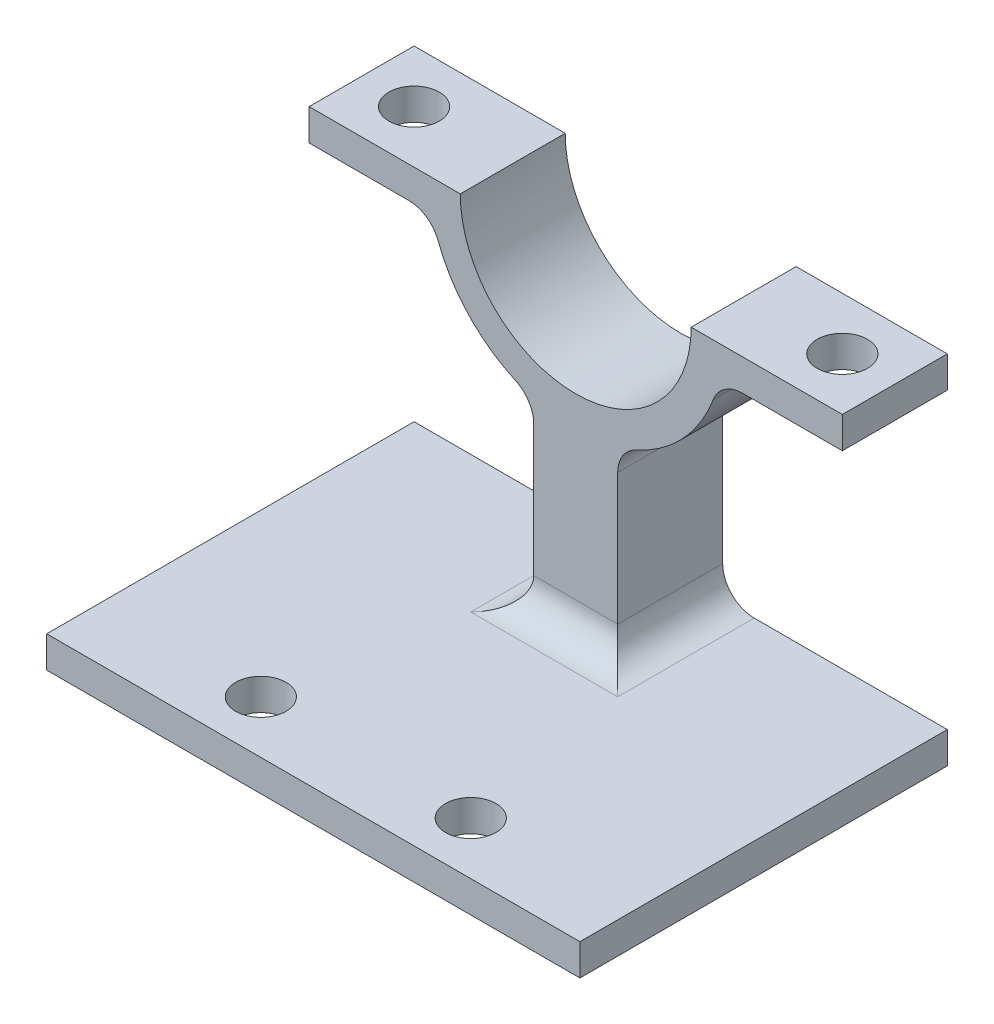
ISO-10303-21;
HEADER;
FILE_DESCRIPTION(('STEP AP214'),'2;1');
FILE_NAME('part.step','',(''),(''),'','','');
FILE_SCHEMA(('AUTOMOTIVE_DESIGN { 1 0 10303 214 1 1 1 1 }'));
ENDSEC;
DATA;
#1=APPLICATION_CONTEXT('core data for automotive mechanical design processes');
#2=APPLICATION_PROTOCOL_DEFINITION('international standard','automotive_design',2000,#1);
#3=PRODUCT_CONTEXT('',#1,'mechanical');
#4=PRODUCT('Part','Part','',(#3));
#5=PRODUCT_RELATED_PRODUCT_CATEGORY('part','',(#4));
#6=PRODUCT_DEFINITION_FORMATION('','',#4);
#7=PRODUCT_DEFINITION_CONTEXT('part definition',#1,'design');
#8=PRODUCT_DEFINITION('design','',#6,#7);
#9=PRODUCT_DEFINITION_SHAPE('','',#8);
#10=(LENGTH_UNIT() NAMED_UNIT(*) SI_UNIT(.MILLI.,.METRE.));
#11=(NAMED_UNIT(*) PLANE_ANGLE_UNIT() SI_UNIT($,.RADIAN.));
#12=(NAMED_UNIT(*) SI_UNIT($,.STERADIAN.) SOLID_ANGLE_UNIT());
#13=UNCERTAINTY_MEASURE_WITH_UNIT(LENGTH_MEASURE(1.E-05),#10,'distance_accuracy_value','');
#14=(GEOMETRIC_REPRESENTATION_CONTEXT(3) GLOBAL_UNCERTAINTY_ASSIGNED_CONTEXT((#13)) GLOBAL_UNIT_ASSIGNED_CONTEXT((#10,
#11,#12)) REPRESENTATION_CONTEXT('',''));
#15=CARTESIAN_POINT('',(0.,0.,0.));
#16=DIRECTION('',(0.,0.,1.));
#17=DIRECTION('',(1.,0.,0.));
#18=AXIS2_PLACEMENT_3D('',#15,#16,#17);
#19=CARTESIAN_POINT('',(0.,0.,2.5));
#20=DIRECTION('',(0.,0.,-1.));
#21=DIRECTION('',(-1.,0.,0.));
#22=AXIS2_PLACEMENT_3D('',#19,#20,#21);
#23=CYLINDRICAL_SURFACE('',#22,7.);
#24=CARTESIAN_POINT('',(0.,0.,2.5));
#25=DIRECTION('',(0.,0.,1.));
#26=DIRECTION('',(1.,0.,0.));
#27=AXIS2_PLACEMENT_3D('',#24,#25,#26);
#28=CIRCLE('',#27,7.);
#29=CARTESIAN_POINT('',(2.88235294117647,-6.37903139375339,2.5));
#30=VERTEX_POINT('',#29);
#31=CARTESIAN_POINT('',(6.54951859082988,-2.47058823529412,2.5));
#32=VERTEX_POINT('',#31);
#33=EDGE_CURVE('E245',#30,#32,#28,.T.);
#34=ORIENTED_EDGE('',*,*,#33,.F.);
#35=DIRECTION('',(0.,0.,-1.));
#36=VECTOR('',#35,1.);
#37=CARTESIAN_POINT('',(2.88235294117647,-6.37903139375339,2.5));
#38=LINE('',#37,#36);
#39=CARTESIAN_POINT('',(2.88235294117647,-6.37903139375339,-2.5));
#40=VERTEX_POINT('',#39);
#41=EDGE_CURVE('E309',#30,#40,#38,.T.);
#42=ORIENTED_EDGE('',*,*,#41,.T.);
#43=CARTESIAN_POINT('',(0.,0.,-2.5));
#44=DIRECTION('',(0.,0.,1.));
#45=DIRECTION('',(1.,0.,0.));
#46=AXIS2_PLACEMENT_3D('',#43,#44,#45);
#47=CIRCLE('',#46,7.);
#48=CARTESIAN_POINT('',(6.54951859082988,-2.47058823529412,-2.5));
#49=VERTEX_POINT('',#48);
#50=EDGE_CURVE('E266',#40,#49,#47,.T.);
#51=ORIENTED_EDGE('',*,*,#50,.T.);
#52=DIRECTION('',(0.,0.,-1.));
#53=VECTOR('',#52,1.);
#54=CARTESIAN_POINT('',(6.54951859082989,-2.47058823529412,2.5));
#55=LINE('',#54,#53);
#56=EDGE_CURVE('E307',#49,#32,#55,.F.);
#57=ORIENTED_EDGE('',*,*,#56,.T.);
#58=EDGE_LOOP('',(#34,#42,#51,#57));
#59=FACE_BOUND('',#58,.T.);
#60=ADVANCED_FACE('F32',(#59),#23,.T.);
#61=CARTESIAN_POINT('',(-6.54951859082988,-2.47058823529412,2.5));
#62=VERTEX_POINT('',#61);
#63=CARTESIAN_POINT('',(-2.88235294117647,-6.37903139375339,2.5));
#64=VERTEX_POINT('',#63);
#65=EDGE_CURVE('E248',#62,#64,#28,.T.);
#66=ORIENTED_EDGE('',*,*,#65,.F.);
#67=DIRECTION('',(0.,0.,-1.));
#68=VECTOR('',#67,1.);
#69=CARTESIAN_POINT('',(-6.54951859082988,-2.47058823529412,2.5));
#70=LINE('',#69,#68);
#71=CARTESIAN_POINT('',(-6.54951859082988,-2.47058823529412,-2.5));
#72=VERTEX_POINT('',#71);
#73=EDGE_CURVE('E318',#62,#72,#70,.T.);
#74=ORIENTED_EDGE('',*,*,#73,.T.);
#75=CARTESIAN_POINT('',(-2.88235294117647,-6.37903139375339,-2.5));
#76=VERTEX_POINT('',#75);
#77=EDGE_CURVE('E267',#72,#76,#47,.T.);
#78=ORIENTED_EDGE('',*,*,#77,.T.);
#79=DIRECTION('',(0.,0.,-1.));
#80=VECTOR('',#79,1.);
#81=CARTESIAN_POINT('',(-2.88235294117647,-6.37903139375339,2.5));
#82=LINE('',#81,#80);
#83=EDGE_CURVE('E315',#76,#64,#82,.F.);
#84=ORIENTED_EDGE('',*,*,#83,.T.);
#85=EDGE_LOOP('',(#66,#74,#78,#84));
#86=FACE_BOUND('',#85,.T.);
#87=ADVANCED_FACE('F445',(#86),#23,.T.);
#88=CARTESIAN_POINT('',(0.,0.,2.5));
#89=DIRECTION('',(0.,0.,-1.));
#90=DIRECTION('',(-1.,0.,0.));
#91=AXIS2_PLACEMENT_3D('',#88,#89,#90);
#92=CYLINDRICAL_SURFACE('',#91,5.5);
#93=CARTESIAN_POINT('',(0.,0.,-2.5));
#94=DIRECTION('',(0.,0.,-1.));
#95=DIRECTION('',(-1.,0.,0.));
#96=AXIS2_PLACEMENT_3D('',#93,#94,#95);
#97=CIRCLE('',#96,5.5);
#98=CARTESIAN_POINT('',(5.5,0.,-2.5));
#99=VERTEX_POINT('',#98);
#100=CARTESIAN_POINT('',(-5.5,0.,-2.5));
#101=VERTEX_POINT('',#100);
#102=EDGE_CURVE('E256',#99,#101,#97,.T.);
#103=ORIENTED_EDGE('',*,*,#102,.T.);
#104=DIRECTION('',(0.,0.,-1.));
#105=VECTOR('',#104,1.);
#106=CARTESIAN_POINT('',(-5.5,0.,2.5));
#107=LINE('',#106,#105);
#108=CARTESIAN_POINT('',(-5.5,0.,2.5));
#109=VERTEX_POINT('',#108);
#110=EDGE_CURVE('E289',#109,#101,#107,.T.);
#111=ORIENTED_EDGE('',*,*,#110,.F.);
#112=CARTESIAN_POINT('',(0.,0.,2.5));
#113=DIRECTION('',(0.,0.,-1.));
#114=DIRECTION('',(-1.,0.,0.));
#115=AXIS2_PLACEMENT_3D('',#112,#113,#114);
#116=CIRCLE('',#115,5.5);
#117=CARTESIAN_POINT('',(5.5,0.,2.5));
#118=VERTEX_POINT('',#117);
#119=EDGE_CURVE('E234',#118,#109,#116,.T.);
#120=ORIENTED_EDGE('',*,*,#119,.F.);
#121=DIRECTION('',(0.,0.,-1.));
#122=VECTOR('',#121,1.);
#123=CARTESIAN_POINT('',(5.5,0.,2.5));
#124=LINE('',#123,#122);
#125=EDGE_CURVE('E255',#118,#99,#124,.T.);
#126=ORIENTED_EDGE('',*,*,#125,.T.);
#127=EDGE_LOOP('',(#103,#111,#120,#126));
#128=FACE_BOUND('',#127,.T.);
#129=ADVANCED_FACE('F424',(#128),#92,.F.);
#130=CARTESIAN_POINT('',(-5.5,0.,2.5));
#131=DIRECTION('',(0.,-1.,0.));
#132=DIRECTION('',(1.,0.,0.));
#133=AXIS2_PLACEMENT_3D('',#130,#131,#132);
#134=PLANE('',#133);
#135=CARTESIAN_POINT('',(-10.2,0.,0.));
#136=DIRECTION('',(0.,1.,0.));
#137=DIRECTION('',(0.,0.,1.));
#138=AXIS2_PLACEMENT_3D('',#135,#136,#137);
#139=CIRCLE('',#138,1.2);
#140=CARTESIAN_POINT('',(-10.2,0.,1.2));
#141=VERTEX_POINT('',#140);
#142=EDGE_CURVE('E225',#141,#141,#139,.T.);
#143=ORIENTED_EDGE('',*,*,#142,.F.);
#144=EDGE_LOOP('',(#143));
#145=FACE_BOUND('',#144,.T.);
#146=DIRECTION('',(-1.,0.,0.));
#147=VECTOR('',#146,1.);
#148=CARTESIAN_POINT('',(-5.5,0.,-2.5));
#149=LINE('',#148,#147);
#150=CARTESIAN_POINT('',(-12.7,0.,-2.5));
#151=VERTEX_POINT('',#150);
#152=EDGE_CURVE('E259',#101,#151,#149,.T.);
#153=ORIENTED_EDGE('',*,*,#152,.T.);
#154=DIRECTION('',(0.,0.,-1.));
#155=VECTOR('',#154,1.);
#156=CARTESIAN_POINT('',(-12.7,0.,2.5));
#157=LINE('',#156,#155);
#158=CARTESIAN_POINT('',(-12.7,0.,2.5));
#159=VERTEX_POINT('',#158);
#160=EDGE_CURVE('E286',#159,#151,#157,.T.);
#161=ORIENTED_EDGE('',*,*,#160,.F.);
#162=DIRECTION('',(-1.,0.,0.));
#163=VECTOR('',#162,1.);
#164=CARTESIAN_POINT('',(-5.5,0.,2.5));
#165=LINE('',#164,#163);
#166=EDGE_CURVE('E237',#109,#159,#165,.T.);
#167=ORIENTED_EDGE('',*,*,#166,.F.);
#168=ORIENTED_EDGE('',*,*,#110,.T.);
#169=EDGE_LOOP('',(#153,#161,#167,#168));
#170=FACE_BOUND('',#169,.T.);
#171=ADVANCED_FACE('F426',(#145,#170),#134,.F.);
#172=CARTESIAN_POINT('',(-12.7,0.,2.5));
#173=DIRECTION('',(1.,0.,0.));
#174=DIRECTION('',(0.,0.,-1.));
#175=AXIS2_PLACEMENT_3D('',#172,#173,#174);
#176=PLANE('',#175);
#177=DIRECTION('',(0.,-1.,0.));
#178=VECTOR('',#177,1.);
#179=CARTESIAN_POINT('',(-12.7,0.,-2.5));
#180=LINE('',#179,#178);
#181=CARTESIAN_POINT('',(-12.7,-1.5,-2.5));
#182=VERTEX_POINT('',#181);
#183=EDGE_CURVE('E261',#151,#182,#180,.T.);
#184=ORIENTED_EDGE('',*,*,#183,.T.);
#185=DIRECTION('',(0.,0.,-1.));
#186=VECTOR('',#185,1.);
#187=CARTESIAN_POINT('',(-12.7,-1.5,2.5));
#188=LINE('',#187,#186);
#189=CARTESIAN_POINT('',(-12.7,-1.5,2.5));
#190=VERTEX_POINT('',#189);
#191=EDGE_CURVE('E283',#190,#182,#188,.T.);
#192=ORIENTED_EDGE('',*,*,#191,.F.);
#193=DIRECTION('',(0.,-1.,0.));
#194=VECTOR('',#193,1.);
#195=CARTESIAN_POINT('',(-12.7,0.,2.5));
#196=LINE('',#195,#194);
#197=EDGE_CURVE('E240',#159,#190,#196,.T.);
#198=ORIENTED_EDGE('',*,*,#197,.F.);
#199=ORIENTED_EDGE('',*,*,#160,.T.);
#200=EDGE_LOOP('',(#184,#192,#198,#199));
#201=FACE_BOUND('',#200,.T.);
#202=ADVANCED_FACE('F433',(#201),#176,.F.);
#203=CARTESIAN_POINT('',(-12.7,-1.5,2.5));
#204=DIRECTION('',(0.,1.,0.));
#205=DIRECTION('',(-1.,0.,0.));
#206=AXIS2_PLACEMENT_3D('',#203,#204,#205);
#207=PLANE('',#206);
#208=CARTESIAN_POINT('',(-10.2,-1.5,0.));
#209=DIRECTION('',(0.,1.,0.));
#210=DIRECTION('',(-1.,0.,0.));
#211=AXIS2_PLACEMENT_3D('',#208,#209,#210);
#212=CIRCLE('',#211,1.2);
#213=CARTESIAN_POINT('',(-11.4,-1.5,0.));
#214=VERTEX_POINT('',#213);
#215=EDGE_CURVE('E233',#214,#214,#212,.T.);
#216=ORIENTED_EDGE('',*,*,#215,.T.);
#217=EDGE_LOOP('',(#216));
#218=FACE_BOUND('',#217,.T.);
#219=DIRECTION('',(1.,0.,0.));
#220=VECTOR('',#219,1.);
#221=CARTESIAN_POINT('',(-12.7,-1.5,-2.5));
#222=LINE('',#221,#220);
#223=CARTESIAN_POINT('',(-7.95298686029343,-1.5,-2.5));
#224=VERTEX_POINT('',#223);
#225=EDGE_CURVE('E263',#182,#224,#222,.T.);
#226=ORIENTED_EDGE('',*,*,#225,.T.);
#227=DIRECTION('',(0.,0.,1.));
#228=VECTOR('',#227,1.);
#229=CARTESIAN_POINT('',(-7.95298686029343,-1.5,2.5));
#230=LINE('',#229,#228);
#231=CARTESIAN_POINT('',(-7.95298686029343,-1.5,2.5));
#232=VERTEX_POINT('',#231);
#233=EDGE_CURVE('E321',#224,#232,#230,.T.);
#234=ORIENTED_EDGE('',*,*,#233,.T.);
#235=DIRECTION('',(1.,0.,0.));
#236=VECTOR('',#235,1.);
#237=CARTESIAN_POINT('',(-12.7,-1.5,2.5));
#238=LINE('',#237,#236);
#239=EDGE_CURVE('E242',#190,#232,#238,.T.);
#240=ORIENTED_EDGE('',*,*,#239,.F.);
#241=ORIENTED_EDGE('',*,*,#191,.T.);
#242=EDGE_LOOP('',(#226,#234,#240,#241));
#243=FACE_BOUND('',#242,.T.);
#244=ADVANCED_FACE('F437',(#218,#243),#207,.F.);
#245=CARTESIAN_POINT('',(12.7,-1.5,2.5));
#246=DIRECTION('',(0.,1.,0.));
#247=DIRECTION('',(-1.,0.,0.));
#248=AXIS2_PLACEMENT_3D('',#245,#246,#247);
#249=PLANE('',#248);
#250=CARTESIAN_POINT('',(10.2,-1.5,0.));
#251=DIRECTION('',(0.,1.,0.));
#252=DIRECTION('',(-1.,0.,0.));
#253=AXIS2_PLACEMENT_3D('',#250,#251,#252);
#254=CIRCLE('',#253,1.2);
#255=CARTESIAN_POINT('',(9.,-1.5,0.));
#256=VERTEX_POINT('',#255);
#257=EDGE_CURVE('E228',#256,#256,#254,.T.);
#258=ORIENTED_EDGE('',*,*,#257,.T.);
#259=EDGE_LOOP('',(#258));
#260=FACE_BOUND('',#259,.T.);
#261=DIRECTION('',(1.,0.,0.));
#262=VECTOR('',#261,1.);
#263=CARTESIAN_POINT('',(12.7,-1.5,2.5));
#264=LINE('',#263,#262);
#265=CARTESIAN_POINT('',(7.95298686029343,-1.5,2.5));
#266=VERTEX_POINT('',#265);
#267=CARTESIAN_POINT('',(12.7,-1.5,2.5));
#268=VERTEX_POINT('',#267);
#269=EDGE_CURVE('E249',#266,#268,#264,.T.);
#270=ORIENTED_EDGE('',*,*,#269,.F.);
#271=DIRECTION('',(0.,0.,1.));
#272=VECTOR('',#271,1.);
#273=CARTESIAN_POINT('',(7.95298686029343,-1.5,-2.5));
#274=LINE('',#273,#272);
#275=CARTESIAN_POINT('',(7.95298686029343,-1.5,-2.5));
#276=VERTEX_POINT('',#275);
#277=EDGE_CURVE('E312',#266,#276,#274,.F.);
#278=ORIENTED_EDGE('',*,*,#277,.T.);
#279=DIRECTION('',(1.,0.,0.));
#280=VECTOR('',#279,1.);
#281=CARTESIAN_POINT('',(12.7,-1.5,-2.5));
#282=LINE('',#281,#280);
#283=CARTESIAN_POINT('',(12.7,-1.5,-2.5));
#284=VERTEX_POINT('',#283);
#285=EDGE_CURVE('E270',#276,#284,#282,.T.);
#286=ORIENTED_EDGE('',*,*,#285,.T.);
#287=DIRECTION('',(0.,0.,-1.));
#288=VECTOR('',#287,1.);
#289=CARTESIAN_POINT('',(12.7,-1.5,2.5));
#290=LINE('',#289,#288);
#291=EDGE_CURVE('E280',#268,#284,#290,.T.);
#292=ORIENTED_EDGE('',*,*,#291,.F.);
#293=EDGE_LOOP('',(#270,#278,#286,#292));
#294=FACE_BOUND('',#293,.T.);
#295=ADVANCED_FACE('F409',(#260,#294),#249,.F.);
#296=CARTESIAN_POINT('',(12.7,0.,2.5));
#297=DIRECTION('',(-1.,0.,0.));
#298=DIRECTION('',(0.,0.,1.));
#299=AXIS2_PLACEMENT_3D('',#296,#297,#298);
#300=PLANE('',#299);
#301=DIRECTION('',(0.,1.,0.));
#302=VECTOR('',#301,1.);
#303=CARTESIAN_POINT('',(12.7,0.,-2.5));
#304=LINE('',#303,#302);
#305=CARTESIAN_POINT('',(12.7,0.,-2.5));
#306=VERTEX_POINT('',#305);
#307=EDGE_CURVE('E272',#284,#306,#304,.T.);
#308=ORIENTED_EDGE('',*,*,#307,.T.);
#309=DIRECTION('',(0.,0.,-1.));
#310=VECTOR('',#309,1.);
#311=CARTESIAN_POINT('',(12.7,0.,2.5));
#312=LINE('',#311,#310);
#313=CARTESIAN_POINT('',(12.7,0.,2.5));
#314=VERTEX_POINT('',#313);
#315=EDGE_CURVE('E277',#314,#306,#312,.T.);
#316=ORIENTED_EDGE('',*,*,#315,.F.);
#317=DIRECTION('',(0.,1.,0.));
#318=VECTOR('',#317,1.);
#319=CARTESIAN_POINT('',(12.7,0.,2.5));
#320=LINE('',#319,#318);
#321=EDGE_CURVE('E251',#268,#314,#320,.T.);
#322=ORIENTED_EDGE('',*,*,#321,.F.);
#323=ORIENTED_EDGE('',*,*,#291,.T.);
#324=EDGE_LOOP('',(#308,#316,#322,#323));
#325=FACE_BOUND('',#324,.T.);
#326=ADVANCED_FACE('F415',(#325),#300,.F.);
#327=CARTESIAN_POINT('',(5.5,0.,2.5));
#328=DIRECTION('',(0.,-1.,0.));
#329=DIRECTION('',(1.,0.,0.));
#330=AXIS2_PLACEMENT_3D('',#327,#328,#329);
#331=PLANE('',#330);
#332=CARTESIAN_POINT('',(10.2,0.,0.));
#333=DIRECTION('',(0.,1.,0.));
#334=DIRECTION('',(0.,0.,-1.));
#335=AXIS2_PLACEMENT_3D('',#332,#333,#334);
#336=CIRCLE('',#335,1.2);
#337=CARTESIAN_POINT('',(10.2,0.,-1.2));
#338=VERTEX_POINT('',#337);
#339=EDGE_CURVE('E223',#338,#338,#336,.T.);
#340=ORIENTED_EDGE('',*,*,#339,.F.);
#341=EDGE_LOOP('',(#340));
#342=FACE_BOUND('',#341,.T.);
#343=DIRECTION('',(-1.,0.,0.));
#344=VECTOR('',#343,1.);
#345=CARTESIAN_POINT('',(5.5,0.,-2.5));
#346=LINE('',#345,#344);
#347=EDGE_CURVE('E238',#306,#99,#346,.T.);
#348=ORIENTED_EDGE('',*,*,#347,.T.);
#349=ORIENTED_EDGE('',*,*,#125,.F.);
#350=DIRECTION('',(-1.,0.,0.));
#351=VECTOR('',#350,1.);
#352=CARTESIAN_POINT('',(5.5,0.,2.5));
#353=LINE('',#352,#351);
#354=EDGE_CURVE('E253',#314,#118,#353,.T.);
#355=ORIENTED_EDGE('',*,*,#354,.F.);
#356=ORIENTED_EDGE('',*,*,#315,.T.);
#357=EDGE_LOOP('',(#348,#349,#355,#356));
#358=FACE_BOUND('',#357,.T.);
#359=ADVANCED_FACE('F421',(#342,#358),#331,.F.);
#360=CARTESIAN_POINT('',(0.,0.,2.5));
#361=DIRECTION('',(0.,0.,-1.));
#362=DIRECTION('',(-1.,0.,0.));
#363=AXIS2_PLACEMENT_3D('',#360,#361,#362);
#364=PLANE('',#363);
#365=DIRECTION('',(0.,-1.,0.));
#366=VECTOR('',#365,1.);
#367=CARTESIAN_POINT('',(-2.,0.001000000000001,2.5));
#368=LINE('',#367,#366);
#369=CARTESIAN_POINT('',(-2.,-7.74596669241483,2.5));
#370=VERTEX_POINT('',#369);
#371=CARTESIAN_POINT('',(-2.,-14.,2.5));
#372=VERTEX_POINT('',#371);
#373=EDGE_CURVE('E221',#370,#372,#368,.T.);
#374=ORIENTED_EDGE('',*,*,#373,.T.);
#375=DIRECTION('',(1.,0.,0.));
#376=VECTOR('',#375,1.);
#377=CARTESIAN_POINT('',(0.,-14.,2.5));
#378=LINE('',#377,#376);
#379=CARTESIAN_POINT('',(2.,-14.,2.5));
#380=VERTEX_POINT('',#379);
#381=EDGE_CURVE('E292',#372,#380,#378,.T.);
#382=ORIENTED_EDGE('',*,*,#381,.T.);
#383=DIRECTION('',(0.,-1.,0.));
#384=VECTOR('',#383,1.);
#385=CARTESIAN_POINT('',(2.,0.001000000000001,2.5));
#386=LINE('',#385,#384);
#387=CARTESIAN_POINT('',(2.,-7.74596669241483,2.5));
#388=VERTEX_POINT('',#387);
#389=EDGE_CURVE('E208',#388,#380,#386,.T.);
#390=ORIENTED_EDGE('',*,*,#389,.F.);
#391=CARTESIAN_POINT('',(3.5,-7.74596669241483,2.5));
#392=DIRECTION('',(0.,0.,-1.));
#393=DIRECTION('',(-1.,0.,0.));
#394=AXIS2_PLACEMENT_3D('',#391,#392,#393);
#395=CIRCLE('',#394,1.5);
#396=EDGE_CURVE('E330',#388,#30,#395,.T.);
#397=ORIENTED_EDGE('',*,*,#396,.T.);
#398=ORIENTED_EDGE('',*,*,#33,.T.);
#399=CARTESIAN_POINT('',(7.95298686029343,-3.,2.5));
#400=DIRECTION('',(0.,0.,-1.));
#401=DIRECTION('',(-1.,0.,0.));
#402=AXIS2_PLACEMENT_3D('',#399,#400,#401);
#403=CIRCLE('',#402,1.5);
#404=EDGE_CURVE('E334',#32,#266,#403,.T.);
#405=ORIENTED_EDGE('',*,*,#404,.T.);
#406=ORIENTED_EDGE('',*,*,#269,.T.);
#407=ORIENTED_EDGE('',*,*,#321,.T.);
#408=ORIENTED_EDGE('',*,*,#354,.T.);
#409=ORIENTED_EDGE('',*,*,#119,.T.);
#410=ORIENTED_EDGE('',*,*,#166,.T.);
#411=ORIENTED_EDGE('',*,*,#197,.T.);
#412=ORIENTED_EDGE('',*,*,#239,.T.);
#413=CARTESIAN_POINT('',(-7.95298686029343,-3.,2.5));
#414=DIRECTION('',(0.,0.,-1.));
#415=DIRECTION('',(-1.,0.,0.));
#416=AXIS2_PLACEMENT_3D('',#413,#414,#415);
#417=CIRCLE('',#416,1.5);
#418=EDGE_CURVE('E338',#232,#62,#417,.T.);
#419=ORIENTED_EDGE('',*,*,#418,.T.);
#420=ORIENTED_EDGE('',*,*,#65,.T.);
#421=CARTESIAN_POINT('',(-3.5,-7.74596669241483,2.5));
#422=DIRECTION('',(0.,0.,-1.));
#423=DIRECTION('',(-1.,0.,0.));
#424=AXIS2_PLACEMENT_3D('',#421,#422,#423);
#425=CIRCLE('',#424,1.5);
#426=EDGE_CURVE('E340',#64,#370,#425,.T.);
#427=ORIENTED_EDGE('',*,*,#426,.T.);
#428=EDGE_LOOP('',(#374,#382,#390,#397,#398,#405,#406,#407,#408,#409,#410,#411,#412,#419,#420,#427));
#429=FACE_BOUND('',#428,.T.);
#430=ADVANCED_FACE('F388',(#429),#364,.F.);
#431=CARTESIAN_POINT('',(0.,0.,-2.5));
#432=DIRECTION('',(0.,0.,-1.));
#433=DIRECTION('',(-1.,0.,0.));
#434=AXIS2_PLACEMENT_3D('',#431,#432,#433);
#435=PLANE('',#434);
#436=ORIENTED_EDGE('',*,*,#102,.F.);
#437=ORIENTED_EDGE('',*,*,#347,.F.);
#438=ORIENTED_EDGE('',*,*,#307,.F.);
#439=ORIENTED_EDGE('',*,*,#285,.F.);
#440=CARTESIAN_POINT('',(7.95298686029343,-3.,-2.5));
#441=DIRECTION('',(0.,0.,-1.));
#442=DIRECTION('',(-1.,0.,0.));
#443=AXIS2_PLACEMENT_3D('',#440,#441,#442);
#444=CIRCLE('',#443,1.5);
#445=EDGE_CURVE('E332',#276,#49,#444,.F.);
#446=ORIENTED_EDGE('',*,*,#445,.T.);
#447=ORIENTED_EDGE('',*,*,#50,.F.);
#448=CARTESIAN_POINT('',(3.5,-7.74596669241483,-2.5));
#449=DIRECTION('',(0.,0.,-1.));
#450=DIRECTION('',(-1.,0.,0.));
#451=AXIS2_PLACEMENT_3D('',#448,#449,#450);
#452=CIRCLE('',#451,1.5);
#453=CARTESIAN_POINT('',(2.,-7.74596669241483,-2.5));
#454=VERTEX_POINT('',#453);
#455=EDGE_CURVE('E328',#40,#454,#452,.F.);
#456=ORIENTED_EDGE('',*,*,#455,.T.);
#457=DIRECTION('',(0.,-1.,0.));
#458=VECTOR('',#457,1.);
#459=CARTESIAN_POINT('',(2.,0.001000000000001,-2.5));
#460=LINE('',#459,#458);
#461=CARTESIAN_POINT('',(2.,-14.,-2.5));
#462=VERTEX_POINT('',#461);
#463=EDGE_CURVE('E211',#454,#462,#460,.T.);
#464=ORIENTED_EDGE('',*,*,#463,.T.);
#465=CARTESIAN_POINT('',(3.5,-14.,-2.5));
#466=DIRECTION('',(0.,0.,-1.));
#467=DIRECTION('',(-1.,0.,0.));
#468=AXIS2_PLACEMENT_3D('',#465,#466,#467);
#469=CIRCLE('',#468,1.5);
#470=CARTESIAN_POINT('',(3.5,-15.5,-2.5));
#471=VERTEX_POINT('',#470);
#472=EDGE_CURVE('E326',#462,#471,#469,.F.);
#473=ORIENTED_EDGE('',*,*,#472,.T.);
#474=DIRECTION('',(1.,0.,0.));
#475=VECTOR('',#474,1.);
#476=CARTESIAN_POINT('',(12.7,-15.5,-2.5));
#477=LINE('',#476,#475);
#478=CARTESIAN_POINT('',(12.7,-15.5,-2.5));
#479=VERTEX_POINT('',#478);
#480=EDGE_CURVE('E368',#471,#479,#477,.T.);
#481=ORIENTED_EDGE('',*,*,#480,.T.);
#482=DIRECTION('',(0.,1.,0.));
#483=VECTOR('',#482,1.);
#484=CARTESIAN_POINT('',(12.7,-17.,-2.5));
#485=LINE('',#484,#483);
#486=CARTESIAN_POINT('',(12.7,-17.,-2.5));
#487=VERTEX_POINT('',#486);
#488=EDGE_CURVE('E362',#487,#479,#485,.T.);
#489=ORIENTED_EDGE('',*,*,#488,.F.);
#490=DIRECTION('',(1.,0.,0.));
#491=VECTOR('',#490,1.);
#492=CARTESIAN_POINT('',(12.7,-17.,-2.5));
#493=LINE('',#492,#491);
#494=CARTESIAN_POINT('',(-12.7,-17.,-2.5));
#495=VERTEX_POINT('',#494);
#496=EDGE_CURVE('E199',#495,#487,#493,.T.);
#497=ORIENTED_EDGE('',*,*,#496,.F.);
#498=DIRECTION('',(0.,1.,0.));
#499=VECTOR('',#498,1.);
#500=CARTESIAN_POINT('',(-12.7,-17.,-2.5));
#501=LINE('',#500,#499);
#502=CARTESIAN_POINT('',(-12.7,-15.5,-2.5));
#503=VERTEX_POINT('',#502);
#504=EDGE_CURVE('E213',#495,#503,#501,.T.);
#505=ORIENTED_EDGE('',*,*,#504,.T.);
#506=CARTESIAN_POINT('',(-3.5,-15.5,-2.5));
#507=VERTEX_POINT('',#506);
#508=EDGE_CURVE('E203',#503,#507,#477,.T.);
#509=ORIENTED_EDGE('',*,*,#508,.T.);
#510=CARTESIAN_POINT('',(-3.5,-14.,-2.5));
#511=DIRECTION('',(0.,0.,-1.));
#512=DIRECTION('',(-1.,0.,0.));
#513=AXIS2_PLACEMENT_3D('',#510,#511,#512);
#514=CIRCLE('',#513,1.5);
#515=CARTESIAN_POINT('',(-2.,-14.,-2.5));
#516=VERTEX_POINT('',#515);
#517=EDGE_CURVE('E11',#507,#516,#514,.F.);
#518=ORIENTED_EDGE('',*,*,#517,.T.);
#519=DIRECTION('',(0.,-1.,0.));
#520=VECTOR('',#519,1.);
#521=CARTESIAN_POINT('',(-2.,0.001000000000001,-2.5));
#522=LINE('',#521,#520);
#523=CARTESIAN_POINT('',(-2.,-7.74596669241483,-2.5));
#524=VERTEX_POINT('',#523);
#525=EDGE_CURVE('E219',#524,#516,#522,.T.);
#526=ORIENTED_EDGE('',*,*,#525,.F.);
#527=CARTESIAN_POINT('',(-3.5,-7.74596669241483,-2.5));
#528=DIRECTION('',(0.,0.,-1.));
#529=DIRECTION('',(-1.,0.,0.));
#530=AXIS2_PLACEMENT_3D('',#527,#528,#529);
#531=CIRCLE('',#530,1.5);
#532=EDGE_CURVE('E41',#524,#76,#531,.F.);
#533=ORIENTED_EDGE('',*,*,#532,.T.);
#534=ORIENTED_EDGE('',*,*,#77,.F.);
#535=CARTESIAN_POINT('',(-7.95298686029343,-3.,-2.5));
#536=DIRECTION('',(0.,0.,-1.));
#537=DIRECTION('',(-1.,0.,0.));
#538=AXIS2_PLACEMENT_3D('',#535,#536,#537);
#539=CIRCLE('',#538,1.5);
#540=EDGE_CURVE('E336',#72,#224,#539,.F.);
#541=ORIENTED_EDGE('',*,*,#540,.T.);
#542=ORIENTED_EDGE('',*,*,#225,.F.);
#543=ORIENTED_EDGE('',*,*,#183,.F.);
#544=ORIENTED_EDGE('',*,*,#152,.F.);
#545=EDGE_LOOP('',(#436,#437,#438,#439,#446,#447,#456,#464,#473,#481,#489,#497,#505,#509,#518,
#526,#533,#534,#541,#542,#543,#544));
#546=FACE_BOUND('',#545,.T.);
#547=ADVANCED_FACE('F374',(#546),#435,.T.);
#548=CARTESIAN_POINT('',(10.2,-7.,0.));
#549=DIRECTION('',(0.,1.,0.));
#550=DIRECTION('',(0.,0.,1.));
#551=AXIS2_PLACEMENT_3D('',#548,#549,#550);
#552=CYLINDRICAL_SURFACE('',#551,1.2);
#553=ORIENTED_EDGE('',*,*,#339,.T.);
#554=EDGE_LOOP('',(#553));
#555=FACE_BOUND('',#554,.T.);
#556=ORIENTED_EDGE('',*,*,#257,.F.);
#557=EDGE_LOOP('',(#556));
#558=FACE_BOUND('',#557,.T.);
#559=ADVANCED_FACE('F527',(#555,#558),#552,.F.);
#560=CARTESIAN_POINT('',(-10.2,-7.,0.));
#561=DIRECTION('',(0.,1.,0.));
#562=DIRECTION('',(0.,0.,1.));
#563=AXIS2_PLACEMENT_3D('',#560,#561,#562);
#564=CYLINDRICAL_SURFACE('',#563,1.2);
#565=ORIENTED_EDGE('',*,*,#142,.T.);
#566=EDGE_LOOP('',(#565));
#567=FACE_BOUND('',#566,.T.);
#568=ORIENTED_EDGE('',*,*,#215,.F.);
#569=EDGE_LOOP('',(#568));
#570=FACE_BOUND('',#569,.T.);
#571=ADVANCED_FACE('F522',(#567,#570),#564,.F.);
#572=CARTESIAN_POINT('',(2.,0.001000000000001,2.5));
#573=DIRECTION('',(-1.,0.,0.));
#574=DIRECTION('',(0.,0.,1.));
#575=AXIS2_PLACEMENT_3D('',#572,#573,#574);
#576=PLANE('',#575);
#577=ORIENTED_EDGE('',*,*,#389,.T.);
#578=DIRECTION('',(0.,0.,-1.));
#579=VECTOR('',#578,1.);
#580=CARTESIAN_POINT('',(2.,-14.,2.5));
#581=LINE('',#580,#579);
#582=EDGE_CURVE('E305',#380,#462,#581,.T.);
#583=ORIENTED_EDGE('',*,*,#582,.T.);
#584=ORIENTED_EDGE('',*,*,#463,.F.);
#585=DIRECTION('',(0.,0.,1.));
#586=VECTOR('',#585,1.);
#587=CARTESIAN_POINT('',(2.,-7.74596669241483,2.5));
#588=LINE('',#587,#586);
#589=EDGE_CURVE('E303',#454,#388,#588,.T.);
#590=ORIENTED_EDGE('',*,*,#589,.T.);
#591=EDGE_LOOP('',(#577,#583,#584,#590));
#592=FACE_BOUND('',#591,.T.);
#593=ADVANCED_FACE('F391',(#592),#576,.F.);
#594=CARTESIAN_POINT('',(-2.,0.001000000000001,2.5));
#595=DIRECTION('',(1.,0.,0.));
#596=DIRECTION('',(0.,0.,-1.));
#597=AXIS2_PLACEMENT_3D('',#594,#595,#596);
#598=PLANE('',#597);
#599=ORIENTED_EDGE('',*,*,#373,.F.);
#600=DIRECTION('',(0.,0.,1.));
#601=VECTOR('',#600,1.);
#602=CARTESIAN_POINT('',(-2.,-7.74596669241483,-2.5));
#603=LINE('',#602,#601);
#604=EDGE_CURVE('E54',#370,#524,#603,.F.);
#605=ORIENTED_EDGE('',*,*,#604,.T.);
#606=ORIENTED_EDGE('',*,*,#525,.T.);
#607=DIRECTION('',(0.,0.,1.));
#608=VECTOR('',#607,1.);
#609=CARTESIAN_POINT('',(-2.,-14.,2.5));
#610=LINE('',#609,#608);
#611=EDGE_CURVE('E323',#516,#372,#610,.T.);
#612=ORIENTED_EDGE('',*,*,#611,.T.);
#613=EDGE_LOOP('',(#599,#605,#606,#612));
#614=FACE_BOUND('',#613,.T.);
#615=ADVANCED_FACE('F450',(#614),#598,.F.);
#616=CARTESIAN_POINT('',(0.,-15.5,0.));
#617=DIRECTION('',(0.,1.,0.));
#618=DIRECTION('',(0.,0.,1.));
#619=AXIS2_PLACEMENT_3D('',#616,#617,#618);
#620=PLANE('',#619);
#621=CARTESIAN_POINT('',(-5.,-15.5,12.5));
#622=DIRECTION('',(0.,1.,0.));
#623=DIRECTION('',(0.,0.,1.));
#624=AXIS2_PLACEMENT_3D('',#621,#622,#623);
#625=CIRCLE('',#624,1.2);
#626=CARTESIAN_POINT('',(-5.,-15.5,13.7));
#627=VERTEX_POINT('',#626);
#628=EDGE_CURVE('E343',#627,#627,#625,.T.);
#629=ORIENTED_EDGE('',*,*,#628,.F.);
#630=EDGE_LOOP('',(#629));
#631=FACE_BOUND('',#630,.T.);
#632=CARTESIAN_POINT('',(5.,-15.5,12.5));
#633=DIRECTION('',(0.,1.,0.));
#634=DIRECTION('',(0.,0.,1.));
#635=AXIS2_PLACEMENT_3D('',#632,#633,#634);
#636=CIRCLE('',#635,1.2);
#637=CARTESIAN_POINT('',(5.,-15.5,13.7));
#638=VERTEX_POINT('',#637);
#639=EDGE_CURVE('E351',#638,#638,#636,.T.);
#640=ORIENTED_EDGE('',*,*,#639,.F.);
#641=EDGE_LOOP('',(#640));
#642=FACE_BOUND('',#641,.T.);
#643=ORIENTED_EDGE('',*,*,#480,.F.);
#644=DIRECTION('',(0.,0.,-1.));
#645=VECTOR('',#644,1.);
#646=CARTESIAN_POINT('',(3.5,-15.5,0.));
#647=LINE('',#646,#645);
#648=CARTESIAN_POINT('',(3.5,-15.5,4.));
#649=VERTEX_POINT('',#648);
#650=EDGE_CURVE('E301',#471,#649,#647,.F.);
#651=ORIENTED_EDGE('',*,*,#650,.T.);
#652=DIRECTION('',(1.,0.,0.));
#653=VECTOR('',#652,1.);
#654=CARTESIAN_POINT('',(0.,-15.5,4.));
#655=LINE('',#654,#653);
#656=CARTESIAN_POINT('',(-3.5,-15.5,4.));
#657=VERTEX_POINT('',#656);
#658=EDGE_CURVE('E299',#649,#657,#655,.F.);
#659=ORIENTED_EDGE('',*,*,#658,.T.);
#660=DIRECTION('',(0.,0.,1.));
#661=VECTOR('',#660,1.);
#662=CARTESIAN_POINT('',(-3.5,-15.5,0.));
#663=LINE('',#662,#661);
#664=EDGE_CURVE('E297',#657,#507,#663,.F.);
#665=ORIENTED_EDGE('',*,*,#664,.T.);
#666=ORIENTED_EDGE('',*,*,#508,.F.);
#667=DIRECTION('',(0.,0.,-1.));
#668=VECTOR('',#667,1.);
#669=CARTESIAN_POINT('',(-12.7,-15.5,-2.5));
#670=LINE('',#669,#668);
#671=CARTESIAN_POINT('',(-12.7,-15.5,15.));
#672=VERTEX_POINT('',#671);
#673=EDGE_CURVE('E366',#672,#503,#670,.T.);
#674=ORIENTED_EDGE('',*,*,#673,.F.);
#675=DIRECTION('',(-1.,0.,0.));
#676=VECTOR('',#675,1.);
#677=CARTESIAN_POINT('',(-12.7,-15.5,15.));
#678=LINE('',#677,#676);
#679=CARTESIAN_POINT('',(12.7,-15.5,15.));
#680=VERTEX_POINT('',#679);
#681=EDGE_CURVE('E364',#680,#672,#678,.T.);
#682=ORIENTED_EDGE('',*,*,#681,.F.);
#683=DIRECTION('',(0.,0.,1.));
#684=VECTOR('',#683,1.);
#685=CARTESIAN_POINT('',(12.7,-15.5,-2.5));
#686=LINE('',#685,#684);
#687=EDGE_CURVE('E207',#479,#680,#686,.T.);
#688=ORIENTED_EDGE('',*,*,#687,.F.);
#689=EDGE_LOOP('',(#643,#651,#659,#665,#666,#674,#682,#688));
#690=FACE_BOUND('',#689,.T.);
#691=ADVANCED_FACE('F379',(#631,#642,#690),#620,.T.);
#692=CARTESIAN_POINT('',(12.7,-17.,-2.5));
#693=DIRECTION('',(-1.,0.,0.));
#694=DIRECTION('',(0.,0.,1.));
#695=AXIS2_PLACEMENT_3D('',#692,#693,#694);
#696=PLANE('',#695);
#697=ORIENTED_EDGE('',*,*,#687,.T.);
#698=DIRECTION('',(0.,1.,0.));
#699=VECTOR('',#698,1.);
#700=CARTESIAN_POINT('',(12.7,-17.,15.));
#701=LINE('',#700,#699);
#702=CARTESIAN_POINT('',(12.7,-17.,15.));
#703=VERTEX_POINT('',#702);
#704=EDGE_CURVE('E187',#703,#680,#701,.T.);
#705=ORIENTED_EDGE('',*,*,#704,.F.);
#706=DIRECTION('',(0.,0.,1.));
#707=VECTOR('',#706,1.);
#708=CARTESIAN_POINT('',(12.7,-17.,-2.5));
#709=LINE('',#708,#707);
#710=EDGE_CURVE('E194',#487,#703,#709,.T.);
#711=ORIENTED_EDGE('',*,*,#710,.F.);
#712=ORIENTED_EDGE('',*,*,#488,.T.);
#713=EDGE_LOOP('',(#697,#705,#711,#712));
#714=FACE_BOUND('',#713,.T.);
#715=ADVANCED_FACE('F205',(#714),#696,.F.);
#716=CARTESIAN_POINT('',(-12.7,-17.,15.));
#717=DIRECTION('',(0.,0.,-1.));
#718=DIRECTION('',(-1.,0.,0.));
#719=AXIS2_PLACEMENT_3D('',#716,#717,#718);
#720=PLANE('',#719);
#721=ORIENTED_EDGE('',*,*,#681,.T.);
#722=DIRECTION('',(0.,1.,0.));
#723=VECTOR('',#722,1.);
#724=CARTESIAN_POINT('',(-12.7,-17.,15.));
#725=LINE('',#724,#723);
#726=CARTESIAN_POINT('',(-12.7,-17.,15.));
#727=VERTEX_POINT('',#726);
#728=EDGE_CURVE('E190',#727,#672,#725,.T.);
#729=ORIENTED_EDGE('',*,*,#728,.F.);
#730=DIRECTION('',(-1.,0.,0.));
#731=VECTOR('',#730,1.);
#732=CARTESIAN_POINT('',(-12.7,-17.,15.));
#733=LINE('',#732,#731);
#734=EDGE_CURVE('E183',#703,#727,#733,.T.);
#735=ORIENTED_EDGE('',*,*,#734,.F.);
#736=ORIENTED_EDGE('',*,*,#704,.T.);
#737=EDGE_LOOP('',(#721,#729,#735,#736));
#738=FACE_BOUND('',#737,.T.);
#739=ADVANCED_FACE('F185',(#738),#720,.F.);
#740=CARTESIAN_POINT('',(-12.7,-17.,-2.5));
#741=DIRECTION('',(1.,0.,0.));
#742=DIRECTION('',(0.,0.,-1.));
#743=AXIS2_PLACEMENT_3D('',#740,#741,#742);
#744=PLANE('',#743);
#745=ORIENTED_EDGE('',*,*,#673,.T.);
#746=ORIENTED_EDGE('',*,*,#504,.F.);
#747=DIRECTION('',(0.,0.,-1.));
#748=VECTOR('',#747,1.);
#749=CARTESIAN_POINT('',(-12.7,-17.,-2.5));
#750=LINE('',#749,#748);
#751=EDGE_CURVE('E193',#727,#495,#750,.T.);
#752=ORIENTED_EDGE('',*,*,#751,.F.);
#753=ORIENTED_EDGE('',*,*,#728,.T.);
#754=EDGE_LOOP('',(#745,#746,#752,#753));
#755=FACE_BOUND('',#754,.T.);
#756=ADVANCED_FACE('F455',(#755),#744,.F.);
#757=CARTESIAN_POINT('',(0.,-17.,0.));
#758=DIRECTION('',(0.,1.,0.));
#759=DIRECTION('',(0.,0.,1.));
#760=AXIS2_PLACEMENT_3D('',#757,#758,#759);
#761=PLANE('',#760);
#762=CARTESIAN_POINT('',(-5.,-17.,12.5));
#763=DIRECTION('',(0.,1.,0.));
#764=DIRECTION('',(0.,0.,1.));
#765=AXIS2_PLACEMENT_3D('',#762,#763,#764);
#766=CIRCLE('',#765,1.2);
#767=CARTESIAN_POINT('',(-5.,-17.,13.7));
#768=VERTEX_POINT('',#767);
#769=EDGE_CURVE('E356',#768,#768,#766,.T.);
#770=ORIENTED_EDGE('',*,*,#769,.T.);
#771=EDGE_LOOP('',(#770));
#772=FACE_BOUND('',#771,.T.);
#773=CARTESIAN_POINT('',(5.,-17.,12.5));
#774=DIRECTION('',(0.,1.,0.));
#775=DIRECTION('',(0.,0.,-1.));
#776=AXIS2_PLACEMENT_3D('',#773,#774,#775);
#777=CIRCLE('',#776,1.2);
#778=CARTESIAN_POINT('',(5.,-17.,11.3));
#779=VERTEX_POINT('',#778);
#780=EDGE_CURVE('E718',#779,#779,#777,.T.);
#781=ORIENTED_EDGE('',*,*,#780,.T.);
#782=EDGE_LOOP('',(#781));
#783=FACE_BOUND('',#782,.T.);
#784=ORIENTED_EDGE('',*,*,#710,.T.);
#785=ORIENTED_EDGE('',*,*,#734,.T.);
#786=ORIENTED_EDGE('',*,*,#751,.T.);
#787=ORIENTED_EDGE('',*,*,#496,.T.);
#788=EDGE_LOOP('',(#784,#785,#786,#787));
#789=FACE_BOUND('',#788,.T.);
#790=ADVANCED_FACE('F197',(#772,#783,#789),#761,.F.);
#791=CARTESIAN_POINT('',(-3.5,-14.,2.5));
#792=DIRECTION('',(0.,0.,1.));
#793=DIRECTION('',(1.,0.,0.));
#794=AXIS2_PLACEMENT_3D('',#791,#792,#793);
#795=CYLINDRICAL_SURFACE('',#794,1.5);
#796=ORIENTED_EDGE('',*,*,#517,.F.);
#797=ORIENTED_EDGE('',*,*,#664,.F.);
#798=CARTESIAN_POINT('',(-3.5,-14.,4.));
#799=DIRECTION('',(0.707106781186547,0.,0.707106781186547));
#800=DIRECTION('',(-0.707106781186547,0.,0.707106781186547));
#801=AXIS2_PLACEMENT_3D('',#798,#799,#800);
#802=ELLIPSE('',#801,2.12132034355964,1.5);
#803=EDGE_CURVE('E36',#372,#657,#802,.F.);
#804=ORIENTED_EDGE('',*,*,#803,.F.);
#805=ORIENTED_EDGE('',*,*,#611,.F.);
#806=EDGE_LOOP('',(#796,#797,#804,#805));
#807=FACE_BOUND('',#806,.T.);
#808=ADVANCED_FACE('F383',(#807),#795,.F.);
#809=CARTESIAN_POINT('',(3.5,-14.,2.5));
#810=DIRECTION('',(0.,0.,-1.));
#811=DIRECTION('',(-1.,0.,0.));
#812=AXIS2_PLACEMENT_3D('',#809,#810,#811);
#813=CYLINDRICAL_SURFACE('',#812,1.5);
#814=ORIENTED_EDGE('',*,*,#472,.F.);
#815=ORIENTED_EDGE('',*,*,#582,.F.);
#816=CARTESIAN_POINT('',(3.5,-14.,4.));
#817=DIRECTION('',(0.707106781186547,0.,-0.707106781186547));
#818=DIRECTION('',(-0.707106781186547,0.,-0.707106781186547));
#819=AXIS2_PLACEMENT_3D('',#816,#817,#818);
#820=ELLIPSE('',#819,2.12132034355964,1.5);
#821=EDGE_CURVE('E342',#649,#380,#820,.T.);
#822=ORIENTED_EDGE('',*,*,#821,.F.);
#823=ORIENTED_EDGE('',*,*,#650,.F.);
#824=EDGE_LOOP('',(#814,#815,#822,#823));
#825=FACE_BOUND('',#824,.T.);
#826=ADVANCED_FACE('F454',(#825),#813,.F.);
#827=CARTESIAN_POINT('',(0.,-14.,4.));
#828=DIRECTION('',(1.,0.,0.));
#829=DIRECTION('',(0.,0.,-1.));
#830=AXIS2_PLACEMENT_3D('',#827,#828,#829);
#831=CYLINDRICAL_SURFACE('',#830,1.5);
#832=ORIENTED_EDGE('',*,*,#803,.T.);
#833=ORIENTED_EDGE('',*,*,#658,.F.);
#834=ORIENTED_EDGE('',*,*,#821,.T.);
#835=ORIENTED_EDGE('',*,*,#381,.F.);
#836=EDGE_LOOP('',(#832,#833,#834,#835));
#837=FACE_BOUND('',#836,.T.);
#838=ADVANCED_FACE('F385',(#837),#831,.F.);
#839=CARTESIAN_POINT('',(3.5,-7.74596669241483,2.5));
#840=DIRECTION('',(0.,0.,-1.));
#841=DIRECTION('',(-1.,0.,0.));
#842=AXIS2_PLACEMENT_3D('',#839,#840,#841);
#843=CYLINDRICAL_SURFACE('',#842,1.5);
#844=ORIENTED_EDGE('',*,*,#396,.F.);
#845=ORIENTED_EDGE('',*,*,#589,.F.);
#846=ORIENTED_EDGE('',*,*,#455,.F.);
#847=ORIENTED_EDGE('',*,*,#41,.F.);
#848=EDGE_LOOP('',(#844,#845,#846,#847));
#849=FACE_BOUND('',#848,.T.);
#850=ADVANCED_FACE('F395',(#849),#843,.F.);
#851=CARTESIAN_POINT('',(7.95298686029343,-3.,2.5));
#852=DIRECTION('',(0.,0.,-1.));
#853=DIRECTION('',(-1.,0.,0.));
#854=AXIS2_PLACEMENT_3D('',#851,#852,#853);
#855=CYLINDRICAL_SURFACE('',#854,1.5);
#856=ORIENTED_EDGE('',*,*,#404,.F.);
#857=ORIENTED_EDGE('',*,*,#56,.F.);
#858=ORIENTED_EDGE('',*,*,#445,.F.);
#859=ORIENTED_EDGE('',*,*,#277,.F.);
#860=EDGE_LOOP('',(#856,#857,#858,#859));
#861=FACE_BOUND('',#860,.T.);
#862=ADVANCED_FACE('F404',(#861),#855,.F.);
#863=CARTESIAN_POINT('',(-7.95298686029343,-3.,2.5));
#864=DIRECTION('',(0.,0.,-1.));
#865=DIRECTION('',(-1.,0.,0.));
#866=AXIS2_PLACEMENT_3D('',#863,#864,#865);
#867=CYLINDRICAL_SURFACE('',#866,1.5);
#868=ORIENTED_EDGE('',*,*,#418,.F.);
#869=ORIENTED_EDGE('',*,*,#233,.F.);
#870=ORIENTED_EDGE('',*,*,#540,.F.);
#871=ORIENTED_EDGE('',*,*,#73,.F.);
#872=EDGE_LOOP('',(#868,#869,#870,#871));
#873=FACE_BOUND('',#872,.T.);
#874=ADVANCED_FACE('F440',(#873),#867,.F.);
#875=CARTESIAN_POINT('',(-3.5,-7.74596669241483,2.5));
#876=DIRECTION('',(0.,0.,-1.));
#877=DIRECTION('',(-1.,0.,0.));
#878=AXIS2_PLACEMENT_3D('',#875,#876,#877);
#879=CYLINDRICAL_SURFACE('',#878,1.5);
#880=ORIENTED_EDGE('',*,*,#532,.F.);
#881=ORIENTED_EDGE('',*,*,#604,.F.);
#882=ORIENTED_EDGE('',*,*,#426,.F.);
#883=ORIENTED_EDGE('',*,*,#83,.F.);
#884=EDGE_LOOP('',(#880,#881,#882,#883));
#885=FACE_BOUND('',#884,.T.);
#886=ADVANCED_FACE('F34',(#885),#879,.F.);
#887=CARTESIAN_POINT('',(5.,-17.,12.5));
#888=DIRECTION('',(0.,1.,0.));
#889=DIRECTION('',(0.,0.,1.));
#890=AXIS2_PLACEMENT_3D('',#887,#888,#889);
#891=CYLINDRICAL_SURFACE('',#890,1.2);
#892=ORIENTED_EDGE('',*,*,#639,.T.);
#893=EDGE_LOOP('',(#892));
#894=FACE_BOUND('',#893,.T.);
#895=ORIENTED_EDGE('',*,*,#780,.F.);
#896=EDGE_LOOP('',(#895));
#897=FACE_BOUND('',#896,.T.);
#898=ADVANCED_FACE('F497',(#894,#897),#891,.F.);
#899=CARTESIAN_POINT('',(-5.,-17.,12.5));
#900=DIRECTION('',(0.,1.,0.));
#901=DIRECTION('',(0.,0.,1.));
#902=AXIS2_PLACEMENT_3D('',#899,#900,#901);
#903=CYLINDRICAL_SURFACE('',#902,1.2);
#904=ORIENTED_EDGE('',*,*,#628,.T.);
#905=EDGE_LOOP('',(#904));
#906=FACE_BOUND('',#905,.T.);
#907=ORIENTED_EDGE('',*,*,#769,.F.);
#908=EDGE_LOOP('',(#907));
#909=FACE_BOUND('',#908,.T.);
#910=ADVANCED_FACE('F501',(#906,#909),#903,.F.);
#911=CLOSED_SHELL('',(#60,#87,#129,#171,#202,#244,#295,#326,#359,#430,#547,#559,#571,#593,#615,
#691,#715,#739,#756,#790,#808,#826,#838,#850,#862,#874,#886,#898,#910));
#912=MANIFOLD_SOLID_BREP('B2',#911);
#913=ADVANCED_BREP_SHAPE_REPRESENTATION('',(#18,#912),#14);
#914=SHAPE_DEFINITION_REPRESENTATION(#9,#913);
ENDSEC;
END-ISO-10303-21;
